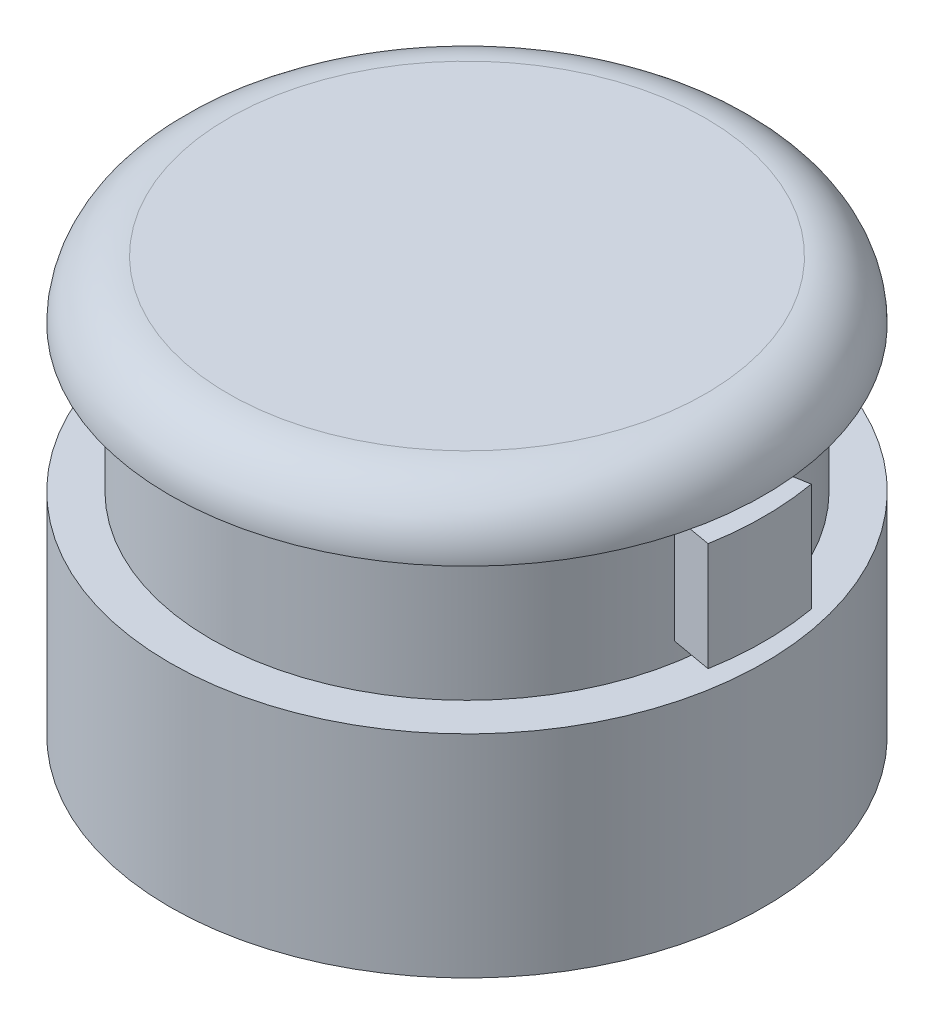
ISO-10303-21;
HEADER;
FILE_DESCRIPTION(('STEP AP214'),'2;1');
FILE_NAME('part.step','',(''),(''),'','','');
FILE_SCHEMA(('AUTOMOTIVE_DESIGN { 1 0 10303 214 1 1 1 1 }'));
ENDSEC;
DATA;
#1=APPLICATION_CONTEXT('core data for automotive mechanical design processes');
#2=APPLICATION_PROTOCOL_DEFINITION('international standard','automotive_design',2000,#1);
#3=PRODUCT_CONTEXT('',#1,'mechanical');
#4=PRODUCT('Part','Part','',(#3));
#5=PRODUCT_RELATED_PRODUCT_CATEGORY('part','',(#4));
#6=PRODUCT_DEFINITION_FORMATION('','',#4);
#7=PRODUCT_DEFINITION_CONTEXT('part definition',#1,'design');
#8=PRODUCT_DEFINITION('design','',#6,#7);
#9=PRODUCT_DEFINITION_SHAPE('','',#8);
#10=(LENGTH_UNIT() NAMED_UNIT(*) SI_UNIT(.MILLI.,.METRE.));
#11=(NAMED_UNIT(*) PLANE_ANGLE_UNIT() SI_UNIT($,.RADIAN.));
#12=(NAMED_UNIT(*) SI_UNIT($,.STERADIAN.) SOLID_ANGLE_UNIT());
#13=UNCERTAINTY_MEASURE_WITH_UNIT(LENGTH_MEASURE(1.E-05),#10,'distance_accuracy_value','');
#14=(GEOMETRIC_REPRESENTATION_CONTEXT(3) GLOBAL_UNCERTAINTY_ASSIGNED_CONTEXT((#13)) GLOBAL_UNIT_ASSIGNED_CONTEXT((#10,
#11,#12)) REPRESENTATION_CONTEXT('',''));
#15=CARTESIAN_POINT('',(0.,0.,0.));
#16=DIRECTION('',(0.,0.,1.));
#17=DIRECTION('',(1.,0.,0.));
#18=AXIS2_PLACEMENT_3D('',#15,#16,#17);
#19=CARTESIAN_POINT('',(0.,0.,0.));
#20=DIRECTION('',(0.,-1.,0.));
#21=DIRECTION('',(0.,0.,-1.));
#22=AXIS2_PLACEMENT_3D('',#19,#20,#21);
#23=CYLINDRICAL_SURFACE('',#22,16.51);
#24=CARTESIAN_POINT('',(0.,2.4892,0.));
#25=DIRECTION('',(0.,-1.,0.));
#26=DIRECTION('',(0.,0.,-1.));
#27=AXIS2_PLACEMENT_3D('',#24,#25,#26);
#28=CIRCLE('',#27,16.51);
#29=CARTESIAN_POINT('',(-16.2769890785311,2.4892,-2.76400552412239));
#30=VERTEX_POINT('',#29);
#31=CARTESIAN_POINT('',(-16.2769890785311,2.4892,2.76400552412239));
#32=VERTEX_POINT('',#31);
#33=EDGE_CURVE('E304',#30,#32,#28,.F.);
#34=ORIENTED_EDGE('',*,*,#33,.F.);
#35=DIRECTION('',(0.,-1.,0.));
#36=VECTOR('',#35,1.);
#37=CARTESIAN_POINT('',(-16.2769890785311,0.,-2.76400552412239));
#38=LINE('',#37,#36);
#39=CARTESIAN_POINT('',(-16.2769890785311,-2.4892,-2.76400552412239));
#40=VERTEX_POINT('',#39);
#41=EDGE_CURVE('E321',#30,#40,#38,.T.);
#42=ORIENTED_EDGE('',*,*,#41,.T.);
#43=CARTESIAN_POINT('',(0.,-2.4892,0.));
#44=DIRECTION('',(0.,1.,0.));
#45=DIRECTION('',(0.,0.,1.));
#46=AXIS2_PLACEMENT_3D('',#43,#44,#45);
#47=CIRCLE('',#46,16.51);
#48=CARTESIAN_POINT('',(-16.2769890785311,-2.4892,2.76400552412239));
#49=VERTEX_POINT('',#48);
#50=EDGE_CURVE('E306',#49,#40,#47,.F.);
#51=ORIENTED_EDGE('',*,*,#50,.F.);
#52=DIRECTION('',(0.,-1.,0.));
#53=VECTOR('',#52,1.);
#54=CARTESIAN_POINT('',(-16.2769890785311,0.,2.76400552412239));
#55=LINE('',#54,#53);
#56=EDGE_CURVE('E318',#49,#32,#55,.F.);
#57=ORIENTED_EDGE('',*,*,#56,.T.);
#58=EDGE_LOOP('',(#34,#42,#51,#57));
#59=FACE_BOUND('',#58,.T.);
#60=CARTESIAN_POINT('',(0.,6.7564,0.));
#61=DIRECTION('',(0.,-1.,0.));
#62=DIRECTION('',(0.,0.,-1.));
#63=AXIS2_PLACEMENT_3D('',#60,#61,#62);
#64=CIRCLE('',#63,16.51);
#65=CARTESIAN_POINT('',(0.,6.7564,-16.51));
#66=VERTEX_POINT('',#65);
#67=EDGE_CURVE('E268',#66,#66,#64,.T.);
#68=ORIENTED_EDGE('',*,*,#67,.F.);
#69=EDGE_LOOP('',(#68));
#70=FACE_BOUND('',#69,.T.);
#71=CARTESIAN_POINT('',(0.,-13.3096,0.));
#72=DIRECTION('',(0.,-1.,0.));
#73=DIRECTION('',(0.,0.,-1.));
#74=AXIS2_PLACEMENT_3D('',#71,#72,#73);
#75=CIRCLE('',#74,16.51);
#76=CARTESIAN_POINT('',(0.,-13.3096,-16.51));
#77=VERTEX_POINT('',#76);
#78=EDGE_CURVE('E271',#77,#77,#75,.T.);
#79=ORIENTED_EDGE('',*,*,#78,.T.);
#80=EDGE_LOOP('',(#79));
#81=FACE_BOUND('',#80,.T.);
#82=CARTESIAN_POINT('',(0.,2.4892,0.));
#83=DIRECTION('',(0.,-1.,0.));
#84=DIRECTION('',(0.,0.,-1.));
#85=AXIS2_PLACEMENT_3D('',#82,#83,#84);
#86=CIRCLE('',#85,16.51);
#87=CARTESIAN_POINT('',(16.2769890785311,2.4892,2.76400552412239));
#88=VERTEX_POINT('',#87);
#89=CARTESIAN_POINT('',(16.2769890785311,2.4892,-2.76400552412239));
#90=VERTEX_POINT('',#89);
#91=EDGE_CURVE('E308',#88,#90,#86,.F.);
#92=ORIENTED_EDGE('',*,*,#91,.F.);
#93=DIRECTION('',(0.,-1.,0.));
#94=VECTOR('',#93,1.);
#95=CARTESIAN_POINT('',(16.2769890785311,0.,2.76400552412239));
#96=LINE('',#95,#94);
#97=CARTESIAN_POINT('',(16.2769890785311,-2.4892,2.76400552412239));
#98=VERTEX_POINT('',#97);
#99=EDGE_CURVE('E315',#88,#98,#96,.T.);
#100=ORIENTED_EDGE('',*,*,#99,.T.);
#101=CARTESIAN_POINT('',(0.,-2.4892,0.));
#102=DIRECTION('',(0.,1.,0.));
#103=DIRECTION('',(0.,0.,1.));
#104=AXIS2_PLACEMENT_3D('',#101,#102,#103);
#105=CIRCLE('',#104,16.51);
#106=CARTESIAN_POINT('',(16.2769890785311,-2.4892,-2.76400552412239));
#107=VERTEX_POINT('',#106);
#108=EDGE_CURVE('E310',#107,#98,#105,.F.);
#109=ORIENTED_EDGE('',*,*,#108,.F.);
#110=DIRECTION('',(0.,-1.,0.));
#111=VECTOR('',#110,1.);
#112=CARTESIAN_POINT('',(16.2769890785311,0.,-2.76400552412239));
#113=LINE('',#112,#111);
#114=EDGE_CURVE('E312',#107,#90,#113,.F.);
#115=ORIENTED_EDGE('',*,*,#114,.T.);
#116=EDGE_LOOP('',(#92,#100,#109,#115));
#117=FACE_BOUND('',#116,.T.);
#118=ADVANCED_FACE('F40',(#59,#70,#81,#117),#23,.F.);
#119=CARTESIAN_POINT('',(0.,9.1059,0.));
#120=DIRECTION('',(0.,-1.,0.));
#121=DIRECTION('',(0.,0.,-1.));
#122=AXIS2_PLACEMENT_3D('',#119,#120,#121);
#123=PLANE('',#122);
#124=CARTESIAN_POINT('',(0.,9.1059,0.));
#125=DIRECTION('',(0.,-1.,0.));
#126=DIRECTION('',(0.,0.,-1.));
#127=AXIS2_PLACEMENT_3D('',#124,#125,#126);
#128=CIRCLE('',#127,16.5735000686635);
#129=CARTESIAN_POINT('',(0.,9.1059,-16.5735000686635));
#130=VERTEX_POINT('',#129);
#131=EDGE_CURVE('E301',#130,#130,#128,.F.);
#132=ORIENTED_EDGE('',*,*,#131,.T.);
#133=EDGE_LOOP('',(#132));
#134=FACE_BOUND('',#133,.T.);
#135=ADVANCED_FACE('F399',(#134),#123,.F.);
#136=CARTESIAN_POINT('',(-17.78,5.04264705882353,0.));
#137=DIRECTION('',(0.,1.,0.));
#138=DIRECTION('',(0.,0.,1.));
#139=AXIS2_PLACEMENT_3D('',#136,#137,#138);
#140=PLANE('',#139);
#141=CARTESIAN_POINT('',(0.,5.04264705882353,0.));
#142=DIRECTION('',(0.,-1.,0.));
#143=DIRECTION('',(0.,0.,-1.));
#144=AXIS2_PLACEMENT_3D('',#141,#142,#143);
#145=CIRCLE('',#144,17.78);
#146=CARTESIAN_POINT('',(0.,5.04264705882353,-17.78));
#147=VERTEX_POINT('',#146);
#148=EDGE_CURVE('E295',#147,#147,#145,.T.);
#149=ORIENTED_EDGE('',*,*,#148,.F.);
#150=EDGE_LOOP('',(#149));
#151=FACE_BOUND('',#150,.T.);
#152=CARTESIAN_POINT('',(0.,5.04264705882353,0.));
#153=DIRECTION('',(0.,-1.,0.));
#154=DIRECTION('',(0.,0.,-1.));
#155=AXIS2_PLACEMENT_3D('',#152,#153,#154);
#156=CIRCLE('',#155,20.6375);
#157=CARTESIAN_POINT('',(0.,5.04264705882353,-20.6375));
#158=VERTEX_POINT('',#157);
#159=EDGE_CURVE('E298',#158,#158,#156,.T.);
#160=ORIENTED_EDGE('',*,*,#159,.T.);
#161=EDGE_LOOP('',(#160));
#162=FACE_BOUND('',#161,.T.);
#163=ADVANCED_FACE('F405',(#151,#162),#140,.F.);
#164=CARTESIAN_POINT('',(0.,0.,0.));
#165=DIRECTION('',(0.,-1.,0.));
#166=DIRECTION('',(0.,0.,-1.));
#167=AXIS2_PLACEMENT_3D('',#164,#165,#166);
#168=CYLINDRICAL_SURFACE('',#167,17.78);
#169=CARTESIAN_POINT('',(0.,3.7592,0.));
#170=DIRECTION('',(0.,-1.,0.));
#171=DIRECTION('',(0.,0.,1.));
#172=AXIS2_PLACEMENT_3D('',#169,#170,#171);
#173=CIRCLE('',#172,17.78);
#174=CARTESIAN_POINT('',(17.5098818485571,3.75919999999999,-3.08746459891803));
#175=VERTEX_POINT('',#174);
#176=CARTESIAN_POINT('',(17.5098818485571,3.7592,3.08746459891803));
#177=VERTEX_POINT('',#176);
#178=EDGE_CURVE('E221',#175,#177,#173,.T.);
#179=ORIENTED_EDGE('',*,*,#178,.F.);
#180=DIRECTION('',(0.,1.,0.));
#181=VECTOR('',#180,1.);
#182=CARTESIAN_POINT('',(17.5098818485571,3.7592,-3.08746459891803));
#183=LINE('',#182,#181);
#184=CARTESIAN_POINT('',(17.5098818485571,-3.7592,-3.08746459891803));
#185=VERTEX_POINT('',#184);
#186=EDGE_CURVE('E214',#185,#175,#183,.T.);
#187=ORIENTED_EDGE('',*,*,#186,.F.);
#188=CARTESIAN_POINT('',(0.,-3.7592,0.));
#189=DIRECTION('',(0.,-1.,0.));
#190=DIRECTION('',(0.,0.,1.));
#191=AXIS2_PLACEMENT_3D('',#188,#189,#190);
#192=CIRCLE('',#191,17.78);
#193=CARTESIAN_POINT('',(17.5098818485571,-3.7592,3.08746459891803));
#194=VERTEX_POINT('',#193);
#195=EDGE_CURVE('E192',#185,#194,#192,.T.);
#196=ORIENTED_EDGE('',*,*,#195,.T.);
#197=DIRECTION('',(0.,1.,0.));
#198=VECTOR('',#197,1.);
#199=CARTESIAN_POINT('',(17.5098818485571,3.7592,3.08746459891803));
#200=LINE('',#199,#198);
#201=EDGE_CURVE('E204',#194,#177,#200,.T.);
#202=ORIENTED_EDGE('',*,*,#201,.T.);
#203=EDGE_LOOP('',(#179,#187,#196,#202));
#204=FACE_BOUND('',#203,.T.);
#205=CARTESIAN_POINT('',(0.,3.7592,0.));
#206=DIRECTION('',(0.,-1.,0.));
#207=DIRECTION('',(0.,0.,-1.));
#208=AXIS2_PLACEMENT_3D('',#205,#206,#207);
#209=CIRCLE('',#208,17.78);
#210=CARTESIAN_POINT('',(-17.5098818485571,3.75919999999999,3.08746459891803));
#211=VERTEX_POINT('',#210);
#212=CARTESIAN_POINT('',(-17.5098818485571,3.7592,-3.08746459891803));
#213=VERTEX_POINT('',#212);
#214=EDGE_CURVE('E255',#211,#213,#209,.T.);
#215=ORIENTED_EDGE('',*,*,#214,.F.);
#216=DIRECTION('',(0.,1.,0.));
#217=VECTOR('',#216,1.);
#218=CARTESIAN_POINT('',(-17.5098818485571,3.7592,3.08746459891803));
#219=LINE('',#218,#217);
#220=CARTESIAN_POINT('',(-17.5098818485571,-3.7592,3.08746459891803));
#221=VERTEX_POINT('',#220);
#222=EDGE_CURVE('E247',#221,#211,#219,.T.);
#223=ORIENTED_EDGE('',*,*,#222,.F.);
#224=CARTESIAN_POINT('',(0.,-3.7592,0.));
#225=DIRECTION('',(0.,-1.,0.));
#226=DIRECTION('',(0.,0.,-1.));
#227=AXIS2_PLACEMENT_3D('',#224,#225,#226);
#228=CIRCLE('',#227,17.78);
#229=CARTESIAN_POINT('',(-17.5098818485571,-3.7592,-3.08746459891803));
#230=VERTEX_POINT('',#229);
#231=EDGE_CURVE('E258',#221,#230,#228,.T.);
#232=ORIENTED_EDGE('',*,*,#231,.T.);
#233=DIRECTION('',(0.,1.,0.));
#234=VECTOR('',#233,1.);
#235=CARTESIAN_POINT('',(-17.5098818485571,3.7592,-3.08746459891803));
#236=LINE('',#235,#234);
#237=EDGE_CURVE('E236',#230,#213,#236,.T.);
#238=ORIENTED_EDGE('',*,*,#237,.T.);
#239=EDGE_LOOP('',(#215,#223,#232,#238));
#240=FACE_BOUND('',#239,.T.);
#241=CARTESIAN_POINT('',(0.,-5.04264705882353,0.));
#242=DIRECTION('',(0.,-1.,0.));
#243=DIRECTION('',(0.,0.,-1.));
#244=AXIS2_PLACEMENT_3D('',#241,#242,#243);
#245=CIRCLE('',#244,17.78);
#246=CARTESIAN_POINT('',(0.,-5.04264705882353,-17.78));
#247=VERTEX_POINT('',#246);
#248=EDGE_CURVE('E292',#247,#247,#245,.T.);
#249=ORIENTED_EDGE('',*,*,#248,.F.);
#250=EDGE_LOOP('',(#249));
#251=FACE_BOUND('',#250,.T.);
#252=ORIENTED_EDGE('',*,*,#148,.T.);
#253=EDGE_LOOP('',(#252));
#254=FACE_BOUND('',#253,.T.);
#255=ADVANCED_FACE('F441',(#204,#240,#251,#254),#168,.T.);
#256=CARTESIAN_POINT('',(-17.78,-5.04264705882353,0.));
#257=DIRECTION('',(0.,-1.,0.));
#258=DIRECTION('',(0.,0.,-1.));
#259=AXIS2_PLACEMENT_3D('',#256,#257,#258);
#260=PLANE('',#259);
#261=CARTESIAN_POINT('',(0.,-5.04264705882353,0.));
#262=DIRECTION('',(0.,-1.,0.));
#263=DIRECTION('',(0.,0.,-1.));
#264=AXIS2_PLACEMENT_3D('',#261,#262,#263);
#265=CIRCLE('',#264,20.6375);
#266=CARTESIAN_POINT('',(0.,-5.04264705882353,-20.6375));
#267=VERTEX_POINT('',#266);
#268=EDGE_CURVE('E289',#267,#267,#265,.T.);
#269=ORIENTED_EDGE('',*,*,#268,.F.);
#270=EDGE_LOOP('',(#269));
#271=FACE_BOUND('',#270,.T.);
#272=ORIENTED_EDGE('',*,*,#248,.T.);
#273=EDGE_LOOP('',(#272));
#274=FACE_BOUND('',#273,.T.);
#275=ADVANCED_FACE('F437',(#271,#274),#260,.F.);
#276=CARTESIAN_POINT('',(0.,0.,0.));
#277=DIRECTION('',(0.,-1.,0.));
#278=DIRECTION('',(0.,0.,-1.));
#279=AXIS2_PLACEMENT_3D('',#276,#277,#278);
#280=CYLINDRICAL_SURFACE('',#279,20.6375);
#281=CARTESIAN_POINT('',(0.,-19.7231,0.));
#282=DIRECTION('',(0.,-1.,0.));
#283=DIRECTION('',(0.,0.,-1.));
#284=AXIS2_PLACEMENT_3D('',#281,#282,#283);
#285=CIRCLE('',#284,20.6375);
#286=CARTESIAN_POINT('',(0.,-19.7231,-20.6375));
#287=VERTEX_POINT('',#286);
#288=EDGE_CURVE('E286',#287,#287,#285,.T.);
#289=ORIENTED_EDGE('',*,*,#288,.F.);
#290=EDGE_LOOP('',(#289));
#291=FACE_BOUND('',#290,.T.);
#292=ORIENTED_EDGE('',*,*,#268,.T.);
#293=EDGE_LOOP('',(#292));
#294=FACE_BOUND('',#293,.T.);
#295=ADVANCED_FACE('F433',(#291,#294),#280,.T.);
#296=CARTESIAN_POINT('',(-20.6375,-19.7231,0.));
#297=DIRECTION('',(0.,1.,0.));
#298=DIRECTION('',(0.,0.,1.));
#299=AXIS2_PLACEMENT_3D('',#296,#297,#298);
#300=PLANE('',#299);
#301=CARTESIAN_POINT('',(0.,-19.7231,0.));
#302=DIRECTION('',(0.,-1.,0.));
#303=DIRECTION('',(0.,0.,-1.));
#304=AXIS2_PLACEMENT_3D('',#301,#302,#303);
#305=CIRCLE('',#304,16.51);
#306=CARTESIAN_POINT('',(0.,-19.7231,-16.51));
#307=VERTEX_POINT('',#306);
#308=EDGE_CURVE('E283',#307,#307,#305,.T.);
#309=ORIENTED_EDGE('',*,*,#308,.F.);
#310=EDGE_LOOP('',(#309));
#311=FACE_BOUND('',#310,.T.);
#312=ORIENTED_EDGE('',*,*,#288,.T.);
#313=EDGE_LOOP('',(#312));
#314=FACE_BOUND('',#313,.T.);
#315=ADVANCED_FACE('F429',(#311,#314),#300,.F.);
#316=CARTESIAN_POINT('',(0.,0.,0.));
#317=DIRECTION('',(0.,-1.,0.));
#318=DIRECTION('',(0.,0.,-1.));
#319=AXIS2_PLACEMENT_3D('',#316,#317,#318);
#320=CYLINDRICAL_SURFACE('',#319,16.51);
#321=CARTESIAN_POINT('',(0.,-15.5956,0.));
#322=DIRECTION('',(0.,-1.,0.));
#323=DIRECTION('',(0.,0.,-1.));
#324=AXIS2_PLACEMENT_3D('',#321,#322,#323);
#325=CIRCLE('',#324,16.51);
#326=CARTESIAN_POINT('',(0.,-15.5956,-16.51));
#327=VERTEX_POINT('',#326);
#328=EDGE_CURVE('E280',#327,#327,#325,.T.);
#329=ORIENTED_EDGE('',*,*,#328,.F.);
#330=EDGE_LOOP('',(#329));
#331=FACE_BOUND('',#330,.T.);
#332=ORIENTED_EDGE('',*,*,#308,.T.);
#333=EDGE_LOOP('',(#332));
#334=FACE_BOUND('',#333,.T.);
#335=ADVANCED_FACE('F425',(#331,#334),#320,.F.);
#336=CARTESIAN_POINT('',(-16.51,-15.5956,0.));
#337=DIRECTION('',(0.,-1.,0.));
#338=DIRECTION('',(0.,0.,-1.));
#339=AXIS2_PLACEMENT_3D('',#336,#337,#338);
#340=PLANE('',#339);
#341=CARTESIAN_POINT('',(0.,-15.5956,0.));
#342=DIRECTION('',(0.,-1.,0.));
#343=DIRECTION('',(0.,0.,-1.));
#344=AXIS2_PLACEMENT_3D('',#341,#342,#343);
#345=CIRCLE('',#344,18.0975);
#346=CARTESIAN_POINT('',(0.,-15.5956,-18.0975));
#347=VERTEX_POINT('',#346);
#348=EDGE_CURVE('E277',#347,#347,#345,.T.);
#349=ORIENTED_EDGE('',*,*,#348,.F.);
#350=EDGE_LOOP('',(#349));
#351=FACE_BOUND('',#350,.T.);
#352=ORIENTED_EDGE('',*,*,#328,.T.);
#353=EDGE_LOOP('',(#352));
#354=FACE_BOUND('',#353,.T.);
#355=ADVANCED_FACE('F421',(#351,#354),#340,.F.);
#356=CARTESIAN_POINT('',(0.,0.,0.));
#357=DIRECTION('',(0.,-1.,0.));
#358=DIRECTION('',(0.,0.,-1.));
#359=AXIS2_PLACEMENT_3D('',#356,#357,#358);
#360=CYLINDRICAL_SURFACE('',#359,18.0975);
#361=CARTESIAN_POINT('',(0.,-13.3096,0.));
#362=DIRECTION('',(0.,-1.,0.));
#363=DIRECTION('',(0.,0.,-1.));
#364=AXIS2_PLACEMENT_3D('',#361,#362,#363);
#365=CIRCLE('',#364,18.0975);
#366=CARTESIAN_POINT('',(0.,-13.3096,-18.0975));
#367=VERTEX_POINT('',#366);
#368=EDGE_CURVE('E274',#367,#367,#365,.T.);
#369=ORIENTED_EDGE('',*,*,#368,.F.);
#370=EDGE_LOOP('',(#369));
#371=FACE_BOUND('',#370,.T.);
#372=ORIENTED_EDGE('',*,*,#348,.T.);
#373=EDGE_LOOP('',(#372));
#374=FACE_BOUND('',#373,.T.);
#375=ADVANCED_FACE('F417',(#371,#374),#360,.F.);
#376=CARTESIAN_POINT('',(-18.0975,-13.3096,0.));
#377=DIRECTION('',(0.,1.,0.));
#378=DIRECTION('',(0.,0.,1.));
#379=AXIS2_PLACEMENT_3D('',#376,#377,#378);
#380=PLANE('',#379);
#381=ORIENTED_EDGE('',*,*,#78,.F.);
#382=EDGE_LOOP('',(#381));
#383=FACE_BOUND('',#382,.T.);
#384=ORIENTED_EDGE('',*,*,#368,.T.);
#385=EDGE_LOOP('',(#384));
#386=FACE_BOUND('',#385,.T.);
#387=ADVANCED_FACE('F414',(#383,#386),#380,.F.);
#388=CARTESIAN_POINT('',(-16.51,6.7564,0.));
#389=DIRECTION('',(0.,1.,0.));
#390=DIRECTION('',(0.,0.,1.));
#391=AXIS2_PLACEMENT_3D('',#388,#389,#390);
#392=PLANE('',#391);
#393=CARTESIAN_POINT('',(0.,6.7564,0.));
#394=DIRECTION('',(0.,-1.,0.));
#395=DIRECTION('',(0.,0.,-1.));
#396=AXIS2_PLACEMENT_3D('',#393,#394,#395);
#397=CIRCLE('',#396,3.8481);
#398=CARTESIAN_POINT('',(0.,6.7564,-3.8481));
#399=VERTEX_POINT('',#398);
#400=EDGE_CURVE('E265',#399,#399,#397,.T.);
#401=ORIENTED_EDGE('',*,*,#400,.F.);
#402=EDGE_LOOP('',(#401));
#403=FACE_BOUND('',#402,.T.);
#404=ORIENTED_EDGE('',*,*,#67,.T.);
#405=EDGE_LOOP('',(#404));
#406=FACE_BOUND('',#405,.T.);
#407=ADVANCED_FACE('F412',(#403,#406),#392,.F.);
#408=CARTESIAN_POINT('',(0.,6.7564,0.));
#409=DIRECTION('',(0.,-1.,0.));
#410=DIRECTION('',(0.,0.,-1.));
#411=AXIS2_PLACEMENT_3D('',#408,#409,#410);
#412=CONICAL_SURFACE('',#411,3.8481,0.785398163397448);
#413=CARTESIAN_POINT('',(0.,7.5184,0.));
#414=DIRECTION('',(0.,-1.,0.));
#415=DIRECTION('',(0.,0.,-1.));
#416=AXIS2_PLACEMENT_3D('',#413,#414,#415);
#417=CIRCLE('',#416,3.0861);
#418=CARTESIAN_POINT('',(0.,7.5184,-3.0861));
#419=VERTEX_POINT('',#418);
#420=EDGE_CURVE('E262',#419,#419,#417,.T.);
#421=ORIENTED_EDGE('',*,*,#420,.F.);
#422=EDGE_LOOP('',(#421));
#423=FACE_BOUND('',#422,.T.);
#424=ORIENTED_EDGE('',*,*,#400,.T.);
#425=EDGE_LOOP('',(#424));
#426=FACE_BOUND('',#425,.T.);
#427=ADVANCED_FACE('F700',(#423,#426),#412,.F.);
#428=CARTESIAN_POINT('',(-3.0861,7.5184,0.));
#429=DIRECTION('',(0.,1.,0.));
#430=DIRECTION('',(0.,0.,1.));
#431=AXIS2_PLACEMENT_3D('',#428,#429,#430);
#432=PLANE('',#431);
#433=ORIENTED_EDGE('',*,*,#420,.T.);
#434=EDGE_LOOP('',(#433));
#435=FACE_BOUND('',#434,.T.);
#436=ADVANCED_FACE('F453',(#435),#432,.F.);
#437=CARTESIAN_POINT('',(0.,5.0419,0.));
#438=DIRECTION('',(0.,1.,0.));
#439=DIRECTION('',(0.,0.,1.));
#440=AXIS2_PLACEMENT_3D('',#437,#438,#439);
#441=TOROIDAL_SURFACE('',#440,16.5735000686635,4.064);
#442=ORIENTED_EDGE('',*,*,#131,.F.);
#443=EDGE_LOOP('',(#442));
#444=FACE_BOUND('',#443,.T.);
#445=ORIENTED_EDGE('',*,*,#159,.F.);
#446=EDGE_LOOP('',(#445));
#447=FACE_BOUND('',#446,.T.);
#448=ADVANCED_FACE('F449',(#444,#447),#441,.T.);
#449=CARTESIAN_POINT('',(0.,0.,0.));
#450=DIRECTION('',(0.,-1.,0.));
#451=DIRECTION('',(0.,0.,-1.));
#452=AXIS2_PLACEMENT_3D('',#449,#450,#451);
#453=CYLINDRICAL_SURFACE('',#452,20.6375000686635);
#454=CARTESIAN_POINT('',(0.,-3.7592,0.));
#455=DIRECTION('',(0.,-1.,0.));
#456=DIRECTION('',(0.,0.,-1.));
#457=AXIS2_PLACEMENT_3D('',#454,#455,#456);
#458=CIRCLE('',#457,20.6375000686635);
#459=CARTESIAN_POINT('',(-20.3239700704098,-3.7592,3.58366427852457));
#460=VERTEX_POINT('',#459);
#461=CARTESIAN_POINT('',(-20.3239700704098,-3.7592,-3.58366427852457));
#462=VERTEX_POINT('',#461);
#463=EDGE_CURVE('E260',#460,#462,#458,.T.);
#464=ORIENTED_EDGE('',*,*,#463,.F.);
#465=DIRECTION('',(0.,-1.,0.));
#466=VECTOR('',#465,1.);
#467=CARTESIAN_POINT('',(-20.3239700704098,3.7592,3.58366427852457));
#468=LINE('',#467,#466);
#469=CARTESIAN_POINT('',(-20.3239700704098,3.7592,3.58366427852457));
#470=VERTEX_POINT('',#469);
#471=EDGE_CURVE('E241',#470,#460,#468,.T.);
#472=ORIENTED_EDGE('',*,*,#471,.F.);
#473=CARTESIAN_POINT('',(0.,3.7592,0.));
#474=DIRECTION('',(0.,-1.,0.));
#475=DIRECTION('',(0.,0.,-1.));
#476=AXIS2_PLACEMENT_3D('',#473,#474,#475);
#477=CIRCLE('',#476,20.6375000686635);
#478=CARTESIAN_POINT('',(-20.3239700704098,3.7592,-3.58366427852457));
#479=VERTEX_POINT('',#478);
#480=EDGE_CURVE('E253',#470,#479,#477,.T.);
#481=ORIENTED_EDGE('',*,*,#480,.T.);
#482=DIRECTION('',(0.,-1.,0.));
#483=VECTOR('',#482,1.);
#484=CARTESIAN_POINT('',(-20.3239700704098,3.7592,-3.58366427852457));
#485=LINE('',#484,#483);
#486=EDGE_CURVE('E228',#479,#462,#485,.T.);
#487=ORIENTED_EDGE('',*,*,#486,.T.);
#488=EDGE_LOOP('',(#464,#472,#481,#487));
#489=FACE_BOUND('',#488,.T.);
#490=ADVANCED_FACE('F452',(#489),#453,.T.);
#491=CARTESIAN_POINT('',(-20.3239700704098,-3.7592,3.58366427852457));
#492=DIRECTION('',(0.,1.,0.));
#493=DIRECTION('',(0.,0.,1.));
#494=AXIS2_PLACEMENT_3D('',#491,#492,#493);
#495=PLANE('',#494);
#496=ORIENTED_EDGE('',*,*,#231,.F.);
#497=DIRECTION('',(0.984807753012208,0.,-0.173648177666931));
#498=VECTOR('',#497,1.);
#499=CARTESIAN_POINT('',(-20.3239700704098,-3.7592,3.58366427852457));
#500=LINE('',#499,#498);
#501=EDGE_CURVE('E244',#460,#221,#500,.T.);
#502=ORIENTED_EDGE('',*,*,#501,.F.);
#503=ORIENTED_EDGE('',*,*,#463,.T.);
#504=DIRECTION('',(0.984807753012208,0.,0.173648177666931));
#505=VECTOR('',#504,1.);
#506=CARTESIAN_POINT('',(-20.3239700704098,-3.7592,-3.58366427852457));
#507=LINE('',#506,#505);
#508=EDGE_CURVE('E233',#462,#230,#507,.T.);
#509=ORIENTED_EDGE('',*,*,#508,.T.);
#510=EDGE_LOOP('',(#496,#502,#503,#509));
#511=FACE_BOUND('',#510,.T.);
#512=ADVANCED_FACE('F660',(#511),#495,.F.);
#513=CARTESIAN_POINT('',(-20.3239700704098,3.7592,3.58366427852457));
#514=DIRECTION('',(0.,-1.,0.));
#515=DIRECTION('',(0.,0.,-1.));
#516=AXIS2_PLACEMENT_3D('',#513,#514,#515);
#517=PLANE('',#516);
#518=DIRECTION('',(-0.984807753012208,0.,0.173648177666931));
#519=VECTOR('',#518,1.);
#520=CARTESIAN_POINT('',(-20.3239700704098,3.7592,3.58366427852457));
#521=LINE('',#520,#519);
#522=EDGE_CURVE('E250',#211,#470,#521,.T.);
#523=ORIENTED_EDGE('',*,*,#522,.F.);
#524=ORIENTED_EDGE('',*,*,#214,.T.);
#525=DIRECTION('',(-0.984807753012208,0.,-0.173648177666931));
#526=VECTOR('',#525,1.);
#527=CARTESIAN_POINT('',(-20.3239700704098,3.7592,-3.58366427852457));
#528=LINE('',#527,#526);
#529=EDGE_CURVE('E238',#213,#479,#528,.T.);
#530=ORIENTED_EDGE('',*,*,#529,.T.);
#531=ORIENTED_EDGE('',*,*,#480,.F.);
#532=EDGE_LOOP('',(#523,#524,#530,#531));
#533=FACE_BOUND('',#532,.T.);
#534=ADVANCED_FACE('F650',(#533),#517,.F.);
#535=CARTESIAN_POINT('',(0.,0.,0.));
#536=DIRECTION('',(0.173648177666931,0.,0.984807753012208));
#537=DIRECTION('',(0.984807753012208,0.,-0.173648177666931));
#538=AXIS2_PLACEMENT_3D('',#535,#536,#537);
#539=PLANE('',#538);
#540=ORIENTED_EDGE('',*,*,#471,.T.);
#541=ORIENTED_EDGE('',*,*,#501,.T.);
#542=ORIENTED_EDGE('',*,*,#222,.T.);
#543=ORIENTED_EDGE('',*,*,#522,.T.);
#544=EDGE_LOOP('',(#540,#541,#542,#543));
#545=FACE_BOUND('',#544,.T.);
#546=ADVANCED_FACE('F640',(#545),#539,.T.);
#547=CARTESIAN_POINT('',(0.,0.,0.));
#548=DIRECTION('',(-0.173648177666931,0.,0.984807753012208));
#549=DIRECTION('',(0.984807753012208,0.,0.173648177666931));
#550=AXIS2_PLACEMENT_3D('',#547,#548,#549);
#551=PLANE('',#550);
#552=ORIENTED_EDGE('',*,*,#486,.F.);
#553=ORIENTED_EDGE('',*,*,#529,.F.);
#554=ORIENTED_EDGE('',*,*,#237,.F.);
#555=ORIENTED_EDGE('',*,*,#508,.F.);
#556=EDGE_LOOP('',(#552,#553,#554,#555));
#557=FACE_BOUND('',#556,.T.);
#558=ADVANCED_FACE('F577',(#557),#551,.F.);
#559=CARTESIAN_POINT('',(0.,-2.4892,0.));
#560=DIRECTION('',(0.,1.,0.));
#561=DIRECTION('',(0.,0.,1.));
#562=AXIS2_PLACEMENT_3D('',#559,#560,#561);
#563=PLANE('',#562);
#564=CARTESIAN_POINT('',(-17.529065161495,-2.4892,-2.97662133367026));
#565=DIRECTION('',(0.,1.,0.));
#566=DIRECTION('',(0.,0.,1.));
#567=AXIS2_PLACEMENT_3D('',#564,#565,#566);
#568=CIRCLE('',#567,1.27);
#569=CARTESIAN_POINT('',(-16.7675018113256,-2.4892,-1.96029399285988));
#570=VERTEX_POINT('',#569);
#571=EDGE_CURVE('E326',#40,#570,#568,.F.);
#572=ORIENTED_EDGE('',*,*,#571,.T.);
#573=CARTESIAN_POINT('',(-16.0059384611562,-2.4892,-0.94396665204949));
#574=DIRECTION('',(0.,1.,0.));
#575=DIRECTION('',(0.,0.,1.));
#576=AXIS2_PLACEMENT_3D('',#573,#574,#575);
#577=CIRCLE('',#576,1.27);
#578=CARTESIAN_POINT('',(-17.2737355669903,-2.4892,-1.01873628785539));
#579=VERTEX_POINT('',#578);
#580=EDGE_CURVE('E348',#570,#579,#577,.T.);
#581=ORIENTED_EDGE('',*,*,#580,.T.);
#582=CARTESIAN_POINT('',(0.,-2.4892,0.));
#583=DIRECTION('',(0.,1.,0.));
#584=DIRECTION('',(0.,0.,1.));
#585=AXIS2_PLACEMENT_3D('',#582,#583,#584);
#586=CIRCLE('',#585,17.30375);
#587=CARTESIAN_POINT('',(-17.2737355669903,-2.4892,1.01873628785538));
#588=VERTEX_POINT('',#587);
#589=EDGE_CURVE('E191',#579,#588,#586,.T.);
#590=ORIENTED_EDGE('',*,*,#589,.T.);
#591=CARTESIAN_POINT('',(-16.0059384611562,-2.4892,0.943966652049476));
#592=DIRECTION('',(0.,1.,0.));
#593=DIRECTION('',(0.,0.,1.));
#594=AXIS2_PLACEMENT_3D('',#591,#592,#593);
#595=CIRCLE('',#594,1.27);
#596=CARTESIAN_POINT('',(-16.7675018113256,-2.4892,1.96029399285987));
#597=VERTEX_POINT('',#596);
#598=EDGE_CURVE('E346',#588,#597,#595,.T.);
#599=ORIENTED_EDGE('',*,*,#598,.T.);
#600=CARTESIAN_POINT('',(-17.529065161495,-2.4892,2.97662133367026));
#601=DIRECTION('',(0.,1.,0.));
#602=DIRECTION('',(0.,0.,1.));
#603=AXIS2_PLACEMENT_3D('',#600,#601,#602);
#604=CIRCLE('',#603,1.27);
#605=EDGE_CURVE('E329',#597,#49,#604,.F.);
#606=ORIENTED_EDGE('',*,*,#605,.T.);
#607=ORIENTED_EDGE('',*,*,#50,.T.);
#608=EDGE_LOOP('',(#572,#581,#590,#599,#606,#607));
#609=FACE_BOUND('',#608,.T.);
#610=ADVANCED_FACE('F568',(#609),#563,.T.);
#611=CARTESIAN_POINT('',(-20.3239700704098,2.4892,3.58366427852457));
#612=DIRECTION('',(0.,-1.,0.));
#613=DIRECTION('',(0.,0.,-1.));
#614=AXIS2_PLACEMENT_3D('',#611,#612,#613);
#615=PLANE('',#614);
#616=CARTESIAN_POINT('',(0.,2.4892,0.));
#617=DIRECTION('',(0.,-1.,0.));
#618=DIRECTION('',(0.,0.,-1.));
#619=AXIS2_PLACEMENT_3D('',#616,#617,#618);
#620=CIRCLE('',#619,17.30375);
#621=CARTESIAN_POINT('',(-17.2737355669903,2.4892,1.01873628785538));
#622=VERTEX_POINT('',#621);
#623=CARTESIAN_POINT('',(-17.2737355669903,2.4892,-1.01873628785539));
#624=VERTEX_POINT('',#623);
#625=EDGE_CURVE('E225',#622,#624,#620,.T.);
#626=ORIENTED_EDGE('',*,*,#625,.T.);
#627=CARTESIAN_POINT('',(-16.0059384611562,2.4892,-0.94396665204949));
#628=DIRECTION('',(0.,-1.,0.));
#629=DIRECTION('',(0.,0.,-1.));
#630=AXIS2_PLACEMENT_3D('',#627,#628,#629);
#631=CIRCLE('',#630,1.27);
#632=CARTESIAN_POINT('',(-16.7675018113256,2.4892,-1.96029399285988));
#633=VERTEX_POINT('',#632);
#634=EDGE_CURVE('E357',#624,#633,#631,.T.);
#635=ORIENTED_EDGE('',*,*,#634,.T.);
#636=CARTESIAN_POINT('',(-17.529065161495,2.4892,-2.97662133367026));
#637=DIRECTION('',(0.,-1.,0.));
#638=DIRECTION('',(0.,0.,-1.));
#639=AXIS2_PLACEMENT_3D('',#636,#637,#638);
#640=CIRCLE('',#639,1.27);
#641=EDGE_CURVE('E324',#633,#30,#640,.F.);
#642=ORIENTED_EDGE('',*,*,#641,.T.);
#643=ORIENTED_EDGE('',*,*,#33,.T.);
#644=CARTESIAN_POINT('',(-17.529065161495,2.4892,2.97662133367026));
#645=DIRECTION('',(0.,-1.,0.));
#646=DIRECTION('',(0.,0.,-1.));
#647=AXIS2_PLACEMENT_3D('',#644,#645,#646);
#648=CIRCLE('',#647,1.27);
#649=CARTESIAN_POINT('',(-16.7675018113256,2.4892,1.96029399285987));
#650=VERTEX_POINT('',#649);
#651=EDGE_CURVE('E331',#32,#650,#648,.F.);
#652=ORIENTED_EDGE('',*,*,#651,.T.);
#653=CARTESIAN_POINT('',(-16.0059384611562,2.4892,0.943966652049476));
#654=DIRECTION('',(0.,-1.,0.));
#655=DIRECTION('',(0.,0.,-1.));
#656=AXIS2_PLACEMENT_3D('',#653,#654,#655);
#657=CIRCLE('',#656,1.27);
#658=EDGE_CURVE('E355',#650,#622,#657,.T.);
#659=ORIENTED_EDGE('',*,*,#658,.T.);
#660=EDGE_LOOP('',(#626,#635,#642,#643,#652,#659));
#661=FACE_BOUND('',#660,.T.);
#662=ADVANCED_FACE('F556',(#661),#615,.T.);
#663=CARTESIAN_POINT('',(0.,14.3420050074662,0.));
#664=DIRECTION('',(0.,-1.,0.));
#665=DIRECTION('',(0.,0.,-1.));
#666=AXIS2_PLACEMENT_3D('',#663,#664,#665);
#667=CYLINDRICAL_SURFACE('',#666,17.30375);
#668=ORIENTED_EDGE('',*,*,#589,.F.);
#669=DIRECTION('',(0.,-1.,0.));
#670=VECTOR('',#669,1.);
#671=CARTESIAN_POINT('',(-17.2737355669903,14.3420050074662,-1.01873628785539));
#672=LINE('',#671,#670);
#673=EDGE_CURVE('E353',#579,#624,#672,.F.);
#674=ORIENTED_EDGE('',*,*,#673,.T.);
#675=ORIENTED_EDGE('',*,*,#625,.F.);
#676=DIRECTION('',(0.,-1.,0.));
#677=VECTOR('',#676,1.);
#678=CARTESIAN_POINT('',(-17.2737355669903,14.3420050074662,1.01873628785538));
#679=LINE('',#678,#677);
#680=EDGE_CURVE('E350',#622,#588,#679,.T.);
#681=ORIENTED_EDGE('',*,*,#680,.T.);
#682=EDGE_LOOP('',(#668,#674,#675,#681));
#683=FACE_BOUND('',#682,.T.);
#684=ADVANCED_FACE('F551',(#683),#667,.F.);
#685=CARTESIAN_POINT('',(0.,0.,0.));
#686=DIRECTION('',(0.,-1.,0.));
#687=DIRECTION('',(0.,0.,1.));
#688=AXIS2_PLACEMENT_3D('',#685,#686,#687);
#689=CYLINDRICAL_SURFACE('',#688,20.6375000686635);
#690=CARTESIAN_POINT('',(0.,-3.7592,0.));
#691=DIRECTION('',(0.,-1.,0.));
#692=DIRECTION('',(0.,0.,1.));
#693=AXIS2_PLACEMENT_3D('',#690,#691,#692);
#694=CIRCLE('',#693,20.6375000686635);
#695=CARTESIAN_POINT('',(20.3239700704098,-3.7592,-3.58366427852457));
#696=VERTEX_POINT('',#695);
#697=CARTESIAN_POINT('',(20.3239700704098,-3.7592,3.58366427852457));
#698=VERTEX_POINT('',#697);
#699=EDGE_CURVE('E179',#696,#698,#694,.T.);
#700=ORIENTED_EDGE('',*,*,#699,.F.);
#701=DIRECTION('',(0.,-1.,0.));
#702=VECTOR('',#701,1.);
#703=CARTESIAN_POINT('',(20.3239700704098,3.7592,-3.58366427852457));
#704=LINE('',#703,#702);
#705=CARTESIAN_POINT('',(20.3239700704098,3.7592,-3.58366427852457));
#706=VERTEX_POINT('',#705);
#707=EDGE_CURVE('E211',#706,#696,#704,.T.);
#708=ORIENTED_EDGE('',*,*,#707,.F.);
#709=CARTESIAN_POINT('',(0.,3.7592,0.));
#710=DIRECTION('',(0.,-1.,0.));
#711=DIRECTION('',(0.,0.,1.));
#712=AXIS2_PLACEMENT_3D('',#709,#710,#711);
#713=CIRCLE('',#712,20.6375000686635);
#714=CARTESIAN_POINT('',(20.3239700704098,3.7592,3.58366427852457));
#715=VERTEX_POINT('',#714);
#716=EDGE_CURVE('E197',#706,#715,#713,.T.);
#717=ORIENTED_EDGE('',*,*,#716,.T.);
#718=DIRECTION('',(0.,-1.,0.));
#719=VECTOR('',#718,1.);
#720=CARTESIAN_POINT('',(20.3239700704098,3.7592,3.58366427852457));
#721=LINE('',#720,#719);
#722=EDGE_CURVE('E195',#715,#698,#721,.T.);
#723=ORIENTED_EDGE('',*,*,#722,.T.);
#724=EDGE_LOOP('',(#700,#708,#717,#723));
#725=FACE_BOUND('',#724,.T.);
#726=ADVANCED_FACE('F196',(#725),#689,.T.);
#727=CARTESIAN_POINT('',(20.3239700704098,-3.7592,-3.58366427852457));
#728=DIRECTION('',(0.,1.,0.));
#729=DIRECTION('',(0.,0.,-1.));
#730=AXIS2_PLACEMENT_3D('',#727,#728,#729);
#731=PLANE('',#730);
#732=ORIENTED_EDGE('',*,*,#195,.F.);
#733=DIRECTION('',(-0.984807753012208,0.,0.173648177666931));
#734=VECTOR('',#733,1.);
#735=CARTESIAN_POINT('',(20.3239700704098,-3.7592,-3.58366427852457));
#736=LINE('',#735,#734);
#737=EDGE_CURVE('E187',#696,#185,#736,.T.);
#738=ORIENTED_EDGE('',*,*,#737,.F.);
#739=ORIENTED_EDGE('',*,*,#699,.T.);
#740=DIRECTION('',(-0.984807753012208,0.,-0.173648177666931));
#741=VECTOR('',#740,1.);
#742=CARTESIAN_POINT('',(20.3239700704098,-3.7592,3.58366427852457));
#743=LINE('',#742,#741);
#744=EDGE_CURVE('E184',#698,#194,#743,.T.);
#745=ORIENTED_EDGE('',*,*,#744,.T.);
#746=EDGE_LOOP('',(#732,#738,#739,#745));
#747=FACE_BOUND('',#746,.T.);
#748=ADVANCED_FACE('F182',(#747),#731,.F.);
#749=CARTESIAN_POINT('',(20.3239700704098,3.7592,-3.58366427852457));
#750=DIRECTION('',(0.,-1.,0.));
#751=DIRECTION('',(0.,0.,1.));
#752=AXIS2_PLACEMENT_3D('',#749,#750,#751);
#753=PLANE('',#752);
#754=DIRECTION('',(0.984807753012208,0.,-0.173648177666931));
#755=VECTOR('',#754,1.);
#756=CARTESIAN_POINT('',(20.3239700704098,3.7592,-3.58366427852457));
#757=LINE('',#756,#755);
#758=EDGE_CURVE('E217',#175,#706,#757,.T.);
#759=ORIENTED_EDGE('',*,*,#758,.F.);
#760=ORIENTED_EDGE('',*,*,#178,.T.);
#761=DIRECTION('',(0.984807753012208,0.,0.173648177666931));
#762=VECTOR('',#761,1.);
#763=CARTESIAN_POINT('',(20.3239700704098,3.7592,3.58366427852457));
#764=LINE('',#763,#762);
#765=EDGE_CURVE('E206',#177,#715,#764,.T.);
#766=ORIENTED_EDGE('',*,*,#765,.T.);
#767=ORIENTED_EDGE('',*,*,#716,.F.);
#768=EDGE_LOOP('',(#759,#760,#766,#767));
#769=FACE_BOUND('',#768,.T.);
#770=ADVANCED_FACE('F601',(#769),#753,.F.);
#771=CARTESIAN_POINT('',(0.,0.,0.));
#772=DIRECTION('',(-0.173648177666931,0.,-0.984807753012208));
#773=DIRECTION('',(-0.984807753012208,0.,0.173648177666931));
#774=AXIS2_PLACEMENT_3D('',#771,#772,#773);
#775=PLANE('',#774);
#776=ORIENTED_EDGE('',*,*,#707,.T.);
#777=ORIENTED_EDGE('',*,*,#737,.T.);
#778=ORIENTED_EDGE('',*,*,#186,.T.);
#779=ORIENTED_EDGE('',*,*,#758,.T.);
#780=EDGE_LOOP('',(#776,#777,#778,#779));
#781=FACE_BOUND('',#780,.T.);
#782=ADVANCED_FACE('F592',(#781),#775,.T.);
#783=CARTESIAN_POINT('',(0.,0.,0.));
#784=DIRECTION('',(0.173648177666931,0.,-0.984807753012208));
#785=DIRECTION('',(-0.984807753012208,0.,-0.173648177666931));
#786=AXIS2_PLACEMENT_3D('',#783,#784,#785);
#787=PLANE('',#786);
#788=ORIENTED_EDGE('',*,*,#722,.F.);
#789=ORIENTED_EDGE('',*,*,#765,.F.);
#790=ORIENTED_EDGE('',*,*,#201,.F.);
#791=ORIENTED_EDGE('',*,*,#744,.F.);
#792=EDGE_LOOP('',(#788,#789,#790,#791));
#793=FACE_BOUND('',#792,.T.);
#794=ADVANCED_FACE('F203',(#793),#787,.F.);
#795=CARTESIAN_POINT('',(0.,-2.4892,0.));
#796=DIRECTION('',(0.,1.,0.));
#797=DIRECTION('',(0.,0.,-1.));
#798=AXIS2_PLACEMENT_3D('',#795,#796,#797);
#799=PLANE('',#798);
#800=CARTESIAN_POINT('',(17.529065161495,-2.4892,2.97662133367026));
#801=DIRECTION('',(0.,1.,0.));
#802=DIRECTION('',(0.,0.,1.));
#803=AXIS2_PLACEMENT_3D('',#800,#801,#802);
#804=CIRCLE('',#803,1.27);
#805=CARTESIAN_POINT('',(16.7675018113256,-2.4892,1.96029399285988));
#806=VERTEX_POINT('',#805);
#807=EDGE_CURVE('E336',#98,#806,#804,.F.);
#808=ORIENTED_EDGE('',*,*,#807,.T.);
#809=CARTESIAN_POINT('',(16.0059384611562,-2.4892,0.94396665204949));
#810=DIRECTION('',(0.,1.,0.));
#811=DIRECTION('',(0.,0.,1.));
#812=AXIS2_PLACEMENT_3D('',#809,#810,#811);
#813=CIRCLE('',#812,1.27);
#814=CARTESIAN_POINT('',(17.2737355669903,-2.4892,1.01873628785539));
#815=VERTEX_POINT('',#814);
#816=EDGE_CURVE('E366',#806,#815,#813,.T.);
#817=ORIENTED_EDGE('',*,*,#816,.T.);
#818=CARTESIAN_POINT('',(0.,-2.4892,0.));
#819=DIRECTION('',(0.,1.,0.));
#820=DIRECTION('',(0.,0.,-1.));
#821=AXIS2_PLACEMENT_3D('',#818,#819,#820);
#822=CIRCLE('',#821,17.30375);
#823=CARTESIAN_POINT('',(17.2737355669903,-2.4892,-1.01873628785538));
#824=VERTEX_POINT('',#823);
#825=EDGE_CURVE('E388',#815,#824,#822,.T.);
#826=ORIENTED_EDGE('',*,*,#825,.T.);
#827=CARTESIAN_POINT('',(16.0059384611562,-2.4892,-0.943966652049476));
#828=DIRECTION('',(0.,1.,0.));
#829=DIRECTION('',(0.,0.,1.));
#830=AXIS2_PLACEMENT_3D('',#827,#828,#829);
#831=CIRCLE('',#830,1.27);
#832=CARTESIAN_POINT('',(16.7675018113256,-2.4892,-1.96029399285987));
#833=VERTEX_POINT('',#832);
#834=EDGE_CURVE('E364',#824,#833,#831,.T.);
#835=ORIENTED_EDGE('',*,*,#834,.T.);
#836=CARTESIAN_POINT('',(17.529065161495,-2.4892,-2.97662133367026));
#837=DIRECTION('',(0.,1.,0.));
#838=DIRECTION('',(0.,0.,1.));
#839=AXIS2_PLACEMENT_3D('',#836,#837,#838);
#840=CIRCLE('',#839,1.27);
#841=EDGE_CURVE('E339',#833,#107,#840,.F.);
#842=ORIENTED_EDGE('',*,*,#841,.T.);
#843=ORIENTED_EDGE('',*,*,#108,.T.);
#844=EDGE_LOOP('',(#808,#817,#826,#835,#842,#843));
#845=FACE_BOUND('',#844,.T.);
#846=ADVANCED_FACE('F387',(#845),#799,.T.);
#847=CARTESIAN_POINT('',(-20.3239700704098,2.4892,3.58366427852457));
#848=DIRECTION('',(0.,-1.,0.));
#849=DIRECTION('',(0.,0.,-1.));
#850=AXIS2_PLACEMENT_3D('',#847,#848,#849);
#851=PLANE('',#850);
#852=CARTESIAN_POINT('',(0.,2.4892,0.));
#853=DIRECTION('',(0.,-1.,0.));
#854=DIRECTION('',(0.,0.,-1.));
#855=AXIS2_PLACEMENT_3D('',#852,#853,#854);
#856=CIRCLE('',#855,17.30375);
#857=CARTESIAN_POINT('',(17.2737355669903,2.4892,-1.01873628785538));
#858=VERTEX_POINT('',#857);
#859=CARTESIAN_POINT('',(17.2737355669903,2.4892,1.01873628785539));
#860=VERTEX_POINT('',#859);
#861=EDGE_CURVE('E201',#858,#860,#856,.T.);
#862=ORIENTED_EDGE('',*,*,#861,.T.);
#863=CARTESIAN_POINT('',(16.0059384611562,2.4892,0.94396665204949));
#864=DIRECTION('',(0.,-1.,0.));
#865=DIRECTION('',(0.,0.,-1.));
#866=AXIS2_PLACEMENT_3D('',#863,#864,#865);
#867=CIRCLE('',#866,1.27);
#868=CARTESIAN_POINT('',(16.7675018113256,2.4892,1.96029399285988));
#869=VERTEX_POINT('',#868);
#870=EDGE_CURVE('E48',#860,#869,#867,.T.);
#871=ORIENTED_EDGE('',*,*,#870,.T.);
#872=CARTESIAN_POINT('',(17.529065161495,2.4892,2.97662133367026));
#873=DIRECTION('',(0.,-1.,0.));
#874=DIRECTION('',(0.,0.,-1.));
#875=AXIS2_PLACEMENT_3D('',#872,#873,#874);
#876=CIRCLE('',#875,1.27);
#877=EDGE_CURVE('E334',#869,#88,#876,.F.);
#878=ORIENTED_EDGE('',*,*,#877,.T.);
#879=ORIENTED_EDGE('',*,*,#91,.T.);
#880=CARTESIAN_POINT('',(17.529065161495,2.4892,-2.97662133367026));
#881=DIRECTION('',(0.,-1.,0.));
#882=DIRECTION('',(0.,0.,-1.));
#883=AXIS2_PLACEMENT_3D('',#880,#881,#882);
#884=CIRCLE('',#883,1.27);
#885=CARTESIAN_POINT('',(16.7675018113256,2.4892,-1.96029399285987));
#886=VERTEX_POINT('',#885);
#887=EDGE_CURVE('E341',#90,#886,#884,.F.);
#888=ORIENTED_EDGE('',*,*,#887,.T.);
#889=CARTESIAN_POINT('',(16.0059384611562,2.4892,-0.943966652049476));
#890=DIRECTION('',(0.,-1.,0.));
#891=DIRECTION('',(0.,0.,-1.));
#892=AXIS2_PLACEMENT_3D('',#889,#890,#891);
#893=CIRCLE('',#892,1.27);
#894=EDGE_CURVE('E372',#886,#858,#893,.T.);
#895=ORIENTED_EDGE('',*,*,#894,.T.);
#896=EDGE_LOOP('',(#862,#871,#878,#879,#888,#895));
#897=FACE_BOUND('',#896,.T.);
#898=ADVANCED_FACE('F376',(#897),#851,.T.);
#899=CARTESIAN_POINT('',(0.,14.3420050074662,0.));
#900=DIRECTION('',(0.,-1.,0.));
#901=DIRECTION('',(0.,0.,-1.));
#902=AXIS2_PLACEMENT_3D('',#899,#900,#901);
#903=CYLINDRICAL_SURFACE('',#902,17.30375);
#904=ORIENTED_EDGE('',*,*,#825,.F.);
#905=DIRECTION('',(0.,-1.,0.));
#906=VECTOR('',#905,1.);
#907=CARTESIAN_POINT('',(17.2737355669903,14.3420050074662,1.01873628785539));
#908=LINE('',#907,#906);
#909=EDGE_CURVE('E61',#815,#860,#908,.F.);
#910=ORIENTED_EDGE('',*,*,#909,.T.);
#911=ORIENTED_EDGE('',*,*,#861,.F.);
#912=DIRECTION('',(0.,-1.,0.));
#913=VECTOR('',#912,1.);
#914=CARTESIAN_POINT('',(17.2737355669903,14.3420050074662,-1.01873628785538));
#915=LINE('',#914,#913);
#916=EDGE_CURVE('E368',#858,#824,#915,.T.);
#917=ORIENTED_EDGE('',*,*,#916,.T.);
#918=EDGE_LOOP('',(#904,#910,#911,#917));
#919=FACE_BOUND('',#918,.T.);
#920=ADVANCED_FACE('F389',(#919),#903,.F.);
#921=CARTESIAN_POINT('',(-17.529065161495,0.,-2.97662133367026));
#922=DIRECTION('',(0.,1.,0.));
#923=DIRECTION('',(0.,0.,1.));
#924=AXIS2_PLACEMENT_3D('',#921,#922,#923);
#925=CYLINDRICAL_SURFACE('',#924,1.27);
#926=ORIENTED_EDGE('',*,*,#641,.F.);
#927=DIRECTION('',(0.,1.,0.));
#928=VECTOR('',#927,1.);
#929=CARTESIAN_POINT('',(-16.7675018113256,0.,-1.96029399285988));
#930=LINE('',#929,#928);
#931=EDGE_CURVE('E343',#633,#570,#930,.F.);
#932=ORIENTED_EDGE('',*,*,#931,.T.);
#933=ORIENTED_EDGE('',*,*,#571,.F.);
#934=ORIENTED_EDGE('',*,*,#41,.F.);
#935=EDGE_LOOP('',(#926,#932,#933,#934));
#936=FACE_BOUND('',#935,.T.);
#937=ADVANCED_FACE('F455',(#936),#925,.T.);
#938=CARTESIAN_POINT('',(-17.529065161495,0.,2.97662133367026));
#939=DIRECTION('',(0.,-1.,0.));
#940=DIRECTION('',(0.,0.,-1.));
#941=AXIS2_PLACEMENT_3D('',#938,#939,#940);
#942=CYLINDRICAL_SURFACE('',#941,1.27);
#943=ORIENTED_EDGE('',*,*,#605,.F.);
#944=DIRECTION('',(0.,-1.,0.));
#945=VECTOR('',#944,1.);
#946=CARTESIAN_POINT('',(-16.7675018113256,0.,1.96029399285987));
#947=LINE('',#946,#945);
#948=EDGE_CURVE('E359',#597,#650,#947,.F.);
#949=ORIENTED_EDGE('',*,*,#948,.T.);
#950=ORIENTED_EDGE('',*,*,#651,.F.);
#951=ORIENTED_EDGE('',*,*,#56,.F.);
#952=EDGE_LOOP('',(#943,#949,#950,#951));
#953=FACE_BOUND('',#952,.T.);
#954=ADVANCED_FACE('F458',(#953),#942,.T.);
#955=CARTESIAN_POINT('',(17.529065161495,0.,2.97662133367026));
#956=DIRECTION('',(0.,1.,0.));
#957=DIRECTION('',(0.,0.,1.));
#958=AXIS2_PLACEMENT_3D('',#955,#956,#957);
#959=CYLINDRICAL_SURFACE('',#958,1.27);
#960=ORIENTED_EDGE('',*,*,#877,.F.);
#961=DIRECTION('',(0.,1.,0.));
#962=VECTOR('',#961,1.);
#963=CARTESIAN_POINT('',(16.7675018113256,0.,1.96029399285988));
#964=LINE('',#963,#962);
#965=EDGE_CURVE('E361',#869,#806,#964,.F.);
#966=ORIENTED_EDGE('',*,*,#965,.T.);
#967=ORIENTED_EDGE('',*,*,#807,.F.);
#968=ORIENTED_EDGE('',*,*,#99,.F.);
#969=EDGE_LOOP('',(#960,#966,#967,#968));
#970=FACE_BOUND('',#969,.T.);
#971=ADVANCED_FACE('F382',(#970),#959,.T.);
#972=CARTESIAN_POINT('',(17.529065161495,0.,-2.97662133367026));
#973=DIRECTION('',(0.,-1.,0.));
#974=DIRECTION('',(0.,0.,-1.));
#975=AXIS2_PLACEMENT_3D('',#972,#973,#974);
#976=CYLINDRICAL_SURFACE('',#975,1.27);
#977=ORIENTED_EDGE('',*,*,#841,.F.);
#978=DIRECTION('',(0.,-1.,0.));
#979=VECTOR('',#978,1.);
#980=CARTESIAN_POINT('',(16.7675018113256,0.,-1.96029399285987));
#981=LINE('',#980,#979);
#982=EDGE_CURVE('E13',#833,#886,#981,.F.);
#983=ORIENTED_EDGE('',*,*,#982,.T.);
#984=ORIENTED_EDGE('',*,*,#887,.F.);
#985=ORIENTED_EDGE('',*,*,#114,.F.);
#986=EDGE_LOOP('',(#977,#983,#984,#985));
#987=FACE_BOUND('',#986,.T.);
#988=ADVANCED_FACE('F396',(#987),#976,.T.);
#989=CARTESIAN_POINT('',(-16.0059384611562,14.3420050074662,-0.94396665204949));
#990=DIRECTION('',(0.,-1.,0.));
#991=DIRECTION('',(0.,0.,-1.));
#992=AXIS2_PLACEMENT_3D('',#989,#990,#991);
#993=CYLINDRICAL_SURFACE('',#992,1.27);
#994=ORIENTED_EDGE('',*,*,#634,.F.);
#995=ORIENTED_EDGE('',*,*,#673,.F.);
#996=ORIENTED_EDGE('',*,*,#580,.F.);
#997=ORIENTED_EDGE('',*,*,#931,.F.);
#998=EDGE_LOOP('',(#994,#995,#996,#997));
#999=FACE_BOUND('',#998,.T.);
#1000=ADVANCED_FACE('F467',(#999),#993,.F.);
#1001=CARTESIAN_POINT('',(-16.0059384611562,0.,0.943966652049476));
#1002=DIRECTION('',(0.,-1.,0.));
#1003=DIRECTION('',(0.,0.,-1.));
#1004=AXIS2_PLACEMENT_3D('',#1001,#1002,#1003);
#1005=CYLINDRICAL_SURFACE('',#1004,1.27);
#1006=ORIENTED_EDGE('',*,*,#658,.F.);
#1007=ORIENTED_EDGE('',*,*,#948,.F.);
#1008=ORIENTED_EDGE('',*,*,#598,.F.);
#1009=ORIENTED_EDGE('',*,*,#680,.F.);
#1010=EDGE_LOOP('',(#1006,#1007,#1008,#1009));
#1011=FACE_BOUND('',#1010,.T.);
#1012=ADVANCED_FACE('F470',(#1011),#1005,.F.);
#1013=CARTESIAN_POINT('',(16.0059384611562,14.3420050074662,0.94396665204949));
#1014=DIRECTION('',(0.,-1.,0.));
#1015=DIRECTION('',(0.,0.,-1.));
#1016=AXIS2_PLACEMENT_3D('',#1013,#1014,#1015);
#1017=CYLINDRICAL_SURFACE('',#1016,1.27);
#1018=ORIENTED_EDGE('',*,*,#870,.F.);
#1019=ORIENTED_EDGE('',*,*,#909,.F.);
#1020=ORIENTED_EDGE('',*,*,#816,.F.);
#1021=ORIENTED_EDGE('',*,*,#965,.F.);
#1022=EDGE_LOOP('',(#1018,#1019,#1020,#1021));
#1023=FACE_BOUND('',#1022,.T.);
#1024=ADVANCED_FACE('F384',(#1023),#1017,.F.);
#1025=CARTESIAN_POINT('',(16.0059384611562,0.,-0.943966652049476));
#1026=DIRECTION('',(0.,-1.,0.));
#1027=DIRECTION('',(0.,0.,-1.));
#1028=AXIS2_PLACEMENT_3D('',#1025,#1026,#1027);
#1029=CYLINDRICAL_SURFACE('',#1028,1.27);
#1030=ORIENTED_EDGE('',*,*,#894,.F.);
#1031=ORIENTED_EDGE('',*,*,#982,.F.);
#1032=ORIENTED_EDGE('',*,*,#834,.F.);
#1033=ORIENTED_EDGE('',*,*,#916,.F.);
#1034=EDGE_LOOP('',(#1030,#1031,#1032,#1033));
#1035=FACE_BOUND('',#1034,.T.);
#1036=ADVANCED_FACE('F42',(#1035),#1029,.F.);
#1037=CLOSED_SHELL('',(#118,#135,#163,#255,#275,#295,#315,#335,#355,#375,#387,#407,#427,#436,
#448,#490,#512,#534,#546,#558,#610,#662,#684,#726,#748,#770,#782,#794,#846,#898,#920,#937,#954,
#971,#988,#1000,#1012,#1024,#1036));
#1038=MANIFOLD_SOLID_BREP('B2',#1037);
#1039=ADVANCED_BREP_SHAPE_REPRESENTATION('',(#18,#1038),#14);
#1040=SHAPE_DEFINITION_REPRESENTATION(#9,#1039);
ENDSEC;
END-ISO-10303-21;
